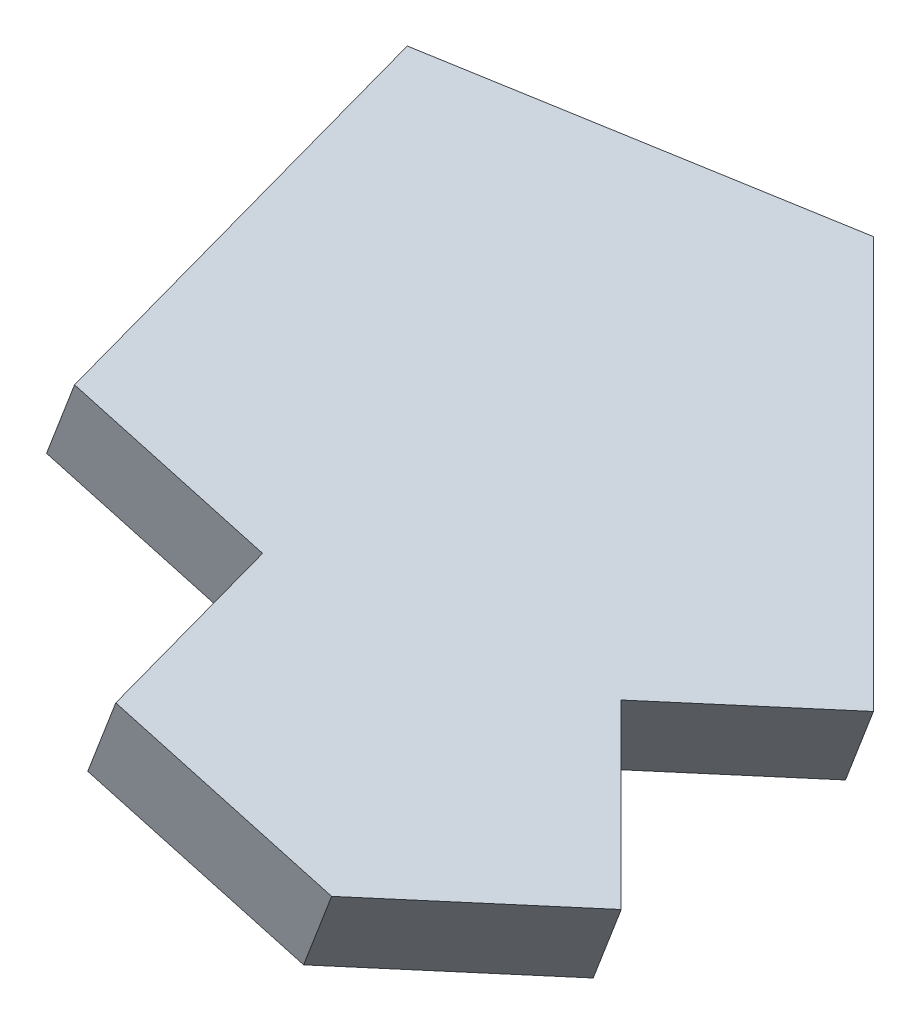
ISO-10303-21;
HEADER;
FILE_DESCRIPTION(('STEP AP214'),'2;1');
FILE_NAME('part.step','',(''),(''),'','','');
FILE_SCHEMA(('AUTOMOTIVE_DESIGN { 1 0 10303 214 1 1 1 1 }'));
ENDSEC;
DATA;
#1=APPLICATION_CONTEXT('core data for automotive mechanical design processes');
#2=APPLICATION_PROTOCOL_DEFINITION('international standard','automotive_design',2000,#1);
#3=PRODUCT_CONTEXT('',#1,'mechanical');
#4=PRODUCT('Part','Part','',(#3));
#5=PRODUCT_RELATED_PRODUCT_CATEGORY('part','',(#4));
#6=PRODUCT_DEFINITION_FORMATION('','',#4);
#7=PRODUCT_DEFINITION_CONTEXT('part definition',#1,'design');
#8=PRODUCT_DEFINITION('design','',#6,#7);
#9=PRODUCT_DEFINITION_SHAPE('','',#8);
#10=(LENGTH_UNIT() NAMED_UNIT(*) SI_UNIT(.MILLI.,.METRE.));
#11=(NAMED_UNIT(*) PLANE_ANGLE_UNIT() SI_UNIT($,.RADIAN.));
#12=(NAMED_UNIT(*) SI_UNIT($,.STERADIAN.) SOLID_ANGLE_UNIT());
#13=UNCERTAINTY_MEASURE_WITH_UNIT(LENGTH_MEASURE(1.E-05),#10,'distance_accuracy_value','');
#14=(GEOMETRIC_REPRESENTATION_CONTEXT(3) GLOBAL_UNCERTAINTY_ASSIGNED_CONTEXT((#13)) GLOBAL_UNIT_ASSIGNED_CONTEXT((#10,
#11,#12)) REPRESENTATION_CONTEXT('',''));
#15=CARTESIAN_POINT('',(0.,0.,0.));
#16=DIRECTION('',(0.,0.,1.));
#17=DIRECTION('',(1.,0.,0.));
#18=AXIS2_PLACEMENT_3D('',#15,#16,#17);
#19=CARTESIAN_POINT('',(38.740977937504,-82.3189480839712,82.4936115759734));
#20=DIRECTION('',(0.866025403784438,-0.467086179482316,-0.178411044884041));
#21=DIRECTION('',(0.474702281385441,0.880146433298151,0.));
#22=AXIS2_PLACEMENT_3D('',#19,#20,#21);
#23=PLANE('',#22);
#24=DIRECTION('',(0.,-0.356822089768082,0.934172358964629));
#25=VECTOR('',#24,1.);
#26=CARTESIAN_POINT('',(37.340977937504,-84.5841956682256,81.6283639917357));
#27=LINE('',#26,#25);
#28=CARTESIAN_POINT('',(37.340977937504,-82.1578054578027,75.2759919507762));
#29=VERTEX_POINT('',#28);
#30=CARTESIAN_POINT('',(37.340977937504,-84.5841956682256,81.6283639917357));
#31=VERTEX_POINT('',#30);
#32=EDGE_CURVE('E137',#29,#31,#27,.T.);
#33=ORIENTED_EDGE('',*,*,#32,.T.);
#34=DIRECTION('',(-0.500000000000002,-0.809016994376602,-0.309016994370612));
#35=VECTOR('',#34,1.);
#36=CARTESIAN_POINT('',(38.740977937504,-82.3189480839712,82.4936115759734));
#37=LINE('',#36,#35);
#38=CARTESIAN_POINT('',(38.740977937504,-82.3189480839712,82.4936115759734));
#39=VERTEX_POINT('',#38);
#40=EDGE_CURVE('E11',#39,#31,#37,.T.);
#41=ORIENTED_EDGE('',*,*,#40,.F.);
#42=DIRECTION('',(0.,-0.356822089768082,0.934172358964629));
#43=VECTOR('',#42,1.);
#44=CARTESIAN_POINT('',(38.740977937504,-82.3189480839712,82.4936115759734));
#45=LINE('',#44,#43);
#46=CARTESIAN_POINT('',(38.740977937504,-79.8925578735482,76.141239535014));
#47=VERTEX_POINT('',#46);
#48=EDGE_CURVE('E156',#47,#39,#45,.T.);
#49=ORIENTED_EDGE('',*,*,#48,.F.);
#50=DIRECTION('',(-0.500000000000002,-0.809016994376602,-0.309016994370612));
#51=VECTOR('',#50,1.);
#52=CARTESIAN_POINT('',(38.740977937504,-79.8925578735482,76.141239535014));
#53=LINE('',#52,#51);
#54=EDGE_CURVE('E133',#47,#29,#53,.T.);
#55=ORIENTED_EDGE('',*,*,#54,.T.);
#56=EDGE_LOOP('',(#33,#41,#49,#55));
#57=FACE_BOUND('',#56,.T.);
#58=ADVANCED_FACE('F34',(#57),#23,.F.);
#59=CARTESIAN_POINT('',(41.7174675795878,-83.9243018866373,81.8804209872687));
#60=DIRECTION('',(-1.53008418807078E-11,0.356822089776337,-0.934172358961476));
#61=DIRECTION('',(0.,0.934172358961476,0.356822089776337));
#62=AXIS2_PLACEMENT_3D('',#59,#60,#61);
#63=PLANE('',#62);
#64=DIRECTION('',(0.866025403784435,-0.467086179476016,-0.178411044900549));
#65=VECTOR('',#64,1.);
#66=CARTESIAN_POINT('',(40.3174675795878,-86.1895494708918,81.015173403031));
#67=LINE('',#66,#65);
#68=CARTESIAN_POINT('',(40.3174675795878,-86.1895494708918,81.015173403031));
#69=VERTEX_POINT('',#68);
#70=EDGE_CURVE('E140',#31,#69,#67,.T.);
#71=ORIENTED_EDGE('',*,*,#70,.T.);
#72=DIRECTION('',(-0.500000000000002,-0.809016994376602,-0.309016994370612));
#73=VECTOR('',#72,1.);
#74=CARTESIAN_POINT('',(41.7174675795878,-83.9243018866373,81.8804209872687));
#75=LINE('',#74,#73);
#76=CARTESIAN_POINT('',(41.7174675795878,-83.9243018866373,81.8804209872687));
#77=VERTEX_POINT('',#76);
#78=EDGE_CURVE('E42',#77,#69,#75,.T.);
#79=ORIENTED_EDGE('',*,*,#78,.F.);
#80=DIRECTION('',(0.866025403784435,-0.467086179476016,-0.178411044900549));
#81=VECTOR('',#80,1.);
#82=CARTESIAN_POINT('',(41.7174675795878,-83.9243018866373,81.8804209872687));
#83=LINE('',#82,#81);
#84=EDGE_CURVE('E94',#39,#77,#83,.T.);
#85=ORIENTED_EDGE('',*,*,#84,.F.);
#86=ORIENTED_EDGE('',*,*,#40,.T.);
#87=EDGE_LOOP('',(#71,#79,#85,#86));
#88=FACE_BOUND('',#87,.T.);
#89=ADVANCED_FACE('F195',(#88),#63,.F.);
#90=CARTESIAN_POINT('',(41.7174675795878,-83.9243018866373,81.8804209872687));
#91=DIRECTION('',(0.866025403784438,-0.467086179480995,-0.178411044887498));
#92=DIRECTION('',(0.474702281384402,0.880146433298712,0.));
#93=AXIS2_PLACEMENT_3D('',#90,#91,#92);
#94=PLANE('',#93);
#95=DIRECTION('',(3.20576898360513E-12,-0.356822089769809,0.934172358963969));
#96=VECTOR('',#95,1.);
#97=CARTESIAN_POINT('',(40.3174675795878,-86.1895494708918,81.015173403031));
#98=LINE('',#97,#96);
#99=CARTESIAN_POINT('',(40.3174675795974,-87.2600157402013,83.8176904799229));
#100=VERTEX_POINT('',#99);
#101=EDGE_CURVE('E142',#69,#100,#98,.T.);
#102=ORIENTED_EDGE('',*,*,#101,.T.);
#103=DIRECTION('',(-0.500000000000002,-0.809016994376602,-0.309016994370612));
#104=VECTOR('',#103,1.);
#105=CARTESIAN_POINT('',(41.7174675795974,-84.9947681559468,84.6829380641606));
#106=LINE('',#105,#104);
#107=CARTESIAN_POINT('',(41.7174675795974,-84.9947681559468,84.6829380641606));
#108=VERTEX_POINT('',#107);
#109=EDGE_CURVE('E166',#108,#100,#106,.T.);
#110=ORIENTED_EDGE('',*,*,#109,.F.);
#111=DIRECTION('',(3.20576898360513E-12,-0.356822089769809,0.934172358963969));
#112=VECTOR('',#111,1.);
#113=CARTESIAN_POINT('',(41.7174675795878,-83.9243018866373,81.8804209872687));
#114=LINE('',#113,#112);
#115=EDGE_CURVE('E174',#77,#108,#114,.T.);
#116=ORIENTED_EDGE('',*,*,#115,.F.);
#117=ORIENTED_EDGE('',*,*,#78,.T.);
#118=EDGE_LOOP('',(#102,#110,#116,#117));
#119=FACE_BOUND('',#118,.T.);
#120=ADVANCED_FACE('F172',(#119),#94,.F.);
#121=CARTESIAN_POINT('',(44.1423387101939,-86.3026094585189,84.183387138542));
#122=DIRECTION('',(0.,0.356822089768079,-0.93417235896463));
#123=DIRECTION('',(0.,0.93417235896463,0.356822089768079));
#124=AXIS2_PLACEMENT_3D('',#121,#122,#123);
#125=PLANE('',#124);
#126=DIRECTION('',(0.866025403784432,-0.467086179482328,-0.178411044884036));
#127=VECTOR('',#126,1.);
#128=CARTESIAN_POINT('',(42.7423387101939,-88.5678570427734,83.3181395543043));
#129=LINE('',#128,#127);
#130=CARTESIAN_POINT('',(43.7347155175936,-89.1030901774478,83.1136986887671));
#131=VERTEX_POINT('',#130);
#132=EDGE_CURVE('E145',#100,#131,#129,.T.);
#133=ORIENTED_EDGE('',*,*,#132,.T.);
#134=DIRECTION('',(-0.500000000000002,-0.809016994376602,-0.309016994370612));
#135=VECTOR('',#134,1.);
#136=CARTESIAN_POINT('',(45.1347155175936,-86.8378425931933,83.9789462730048));
#137=LINE('',#136,#135);
#138=CARTESIAN_POINT('',(45.1347155175936,-86.8378425931933,83.9789462730048));
#139=VERTEX_POINT('',#138);
#140=EDGE_CURVE('E163',#139,#131,#137,.T.);
#141=ORIENTED_EDGE('',*,*,#140,.F.);
#142=DIRECTION('',(0.866025403784438,-0.467086179490049,-0.178411044863795));
#143=VECTOR('',#142,1.);
#144=CARTESIAN_POINT('',(44.1423387101939,-86.3026094585189,84.183387138542));
#145=LINE('',#144,#143);
#146=EDGE_CURVE('E186',#108,#139,#145,.T.);
#147=ORIENTED_EDGE('',*,*,#146,.F.);
#148=ORIENTED_EDGE('',*,*,#109,.T.);
#149=EDGE_LOOP('',(#133,#141,#147,#148));
#150=FACE_BOUND('',#149,.T.);
#151=ADVANCED_FACE('F179',(#150),#125,.F.);
#152=CARTESIAN_POINT('',(47.6817817459845,-87.2729334479331,80.9967891897347));
#153=DIRECTION('',(-0.577350269204418,0.57735026918906,-0.577350269175399));
#154=DIRECTION('',(-0.707106781177143,-0.707106781195952,0.));
#155=AXIS2_PLACEMENT_3D('',#152,#153,#154);
#156=PLANE('',#155);
#157=DIRECTION('',(0.645497224354671,-0.110264089699086,-0.755761314088811));
#158=VECTOR('',#157,1.);
#159=CARTESIAN_POINT('',(46.2817817459845,-89.5381810321876,80.131541605497));
#160=LINE('',#159,#158);
#161=CARTESIAN_POINT('',(46.2817817459845,-89.5381810321876,80.131541605497));
#162=VERTEX_POINT('',#161);
#163=EDGE_CURVE('E148',#131,#162,#160,.T.);
#164=ORIENTED_EDGE('',*,*,#163,.T.);
#165=DIRECTION('',(-0.500000000000002,-0.809016994376602,-0.309016994370612));
#166=VECTOR('',#165,1.);
#167=CARTESIAN_POINT('',(47.6817817459845,-87.2729334479331,80.9967891897347));
#168=LINE('',#167,#166);
#169=CARTESIAN_POINT('',(47.6817817459845,-87.2729334479331,80.9967891897347));
#170=VERTEX_POINT('',#169);
#171=EDGE_CURVE('E160',#170,#162,#168,.T.);
#172=ORIENTED_EDGE('',*,*,#171,.F.);
#173=DIRECTION('',(0.645497224354326,-0.110264089698741,-0.755761314089157));
#174=VECTOR('',#173,1.);
#175=CARTESIAN_POINT('',(45.8743895177608,-86.9641939967704,83.1129208692192));
#176=LINE('',#175,#174);
#177=EDGE_CURVE('E185',#139,#170,#176,.T.);
#178=ORIENTED_EDGE('',*,*,#177,.F.);
#179=ORIENTED_EDGE('',*,*,#140,.T.);
#180=EDGE_LOOP('',(#164,#172,#178,#179));
#181=FACE_BOUND('',#180,.T.);
#182=ADVANCED_FACE('F183',(#181),#156,.F.);
#183=CARTESIAN_POINT('',(45.9497309384079,-85.5408826403721,79.2647383821656));
#184=DIRECTION('',(-0.645497224365596,0.110264089710013,0.755761314077886));
#185=DIRECTION('',(0.76039797422379,0.,0.649457404913021));
#186=AXIS2_PLACEMENT_3D('',#183,#184,#185);
#187=PLANE('',#186);
#188=DIRECTION('',(-0.577350269192204,0.577350269186972,-0.577350269189701));
#189=VECTOR('',#188,1.);
#190=CARTESIAN_POINT('',(44.5497309384079,-87.8061302246266,78.3994907979279));
#191=LINE('',#190,#189);
#192=CARTESIAN_POINT('',(44.5497309384079,-87.8061302246266,78.3994907979279));
#193=VERTEX_POINT('',#192);
#194=EDGE_CURVE('E150',#162,#193,#191,.T.);
#195=ORIENTED_EDGE('',*,*,#194,.T.);
#196=DIRECTION('',(-0.500000000000002,-0.809016994376602,-0.309016994370612));
#197=VECTOR('',#196,1.);
#198=CARTESIAN_POINT('',(45.9497309384079,-85.5408826403721,79.2647383821656));
#199=LINE('',#198,#197);
#200=CARTESIAN_POINT('',(45.9497309384079,-85.5408826403721,79.2647383821656));
#201=VERTEX_POINT('',#200);
#202=EDGE_CURVE('E128',#201,#193,#199,.T.);
#203=ORIENTED_EDGE('',*,*,#202,.F.);
#204=DIRECTION('',(-0.577350269192204,0.577350269186972,-0.577350269189701));
#205=VECTOR('',#204,1.);
#206=CARTESIAN_POINT('',(45.9497309384079,-85.5408826403721,79.2647383821656));
#207=LINE('',#206,#205);
#208=EDGE_CURVE('E117',#170,#201,#207,.T.);
#209=ORIENTED_EDGE('',*,*,#208,.F.);
#210=ORIENTED_EDGE('',*,*,#171,.T.);
#211=EDGE_LOOP('',(#195,#203,#209,#210));
#212=FACE_BOUND('',#211,.T.);
#213=ADVANCED_FACE('F207',(#212),#187,.F.);
#214=CARTESIAN_POINT('',(45.9497309384079,-85.5408826403721,79.2647383821656));
#215=DIRECTION('',(-0.577350269183196,0.577350269185435,-0.577350269200246));
#216=DIRECTION('',(0.,0.707106781195618,0.707106781177478));
#217=AXIS2_PLACEMENT_3D('',#214,#215,#216);
#218=PLANE('',#217);
#219=DIRECTION('',(0.645497224373654,-0.110264089718066,-0.755761314069829));
#220=VECTOR('',#219,1.);
#221=CARTESIAN_POINT('',(44.5497309384079,-87.8061302246266,78.3994907979279));
#222=LINE('',#221,#220);
#223=CARTESIAN_POINT('',(46.7682753297688,-88.1851028500316,75.8019737812372));
#224=VERTEX_POINT('',#223);
#225=EDGE_CURVE('E126',#193,#224,#222,.T.);
#226=ORIENTED_EDGE('',*,*,#225,.T.);
#227=DIRECTION('',(-0.500000000000002,-0.809016994376602,-0.309016994370612));
#228=VECTOR('',#227,1.);
#229=CARTESIAN_POINT('',(48.1682753297688,-85.9198552657772,76.6672213654749));
#230=LINE('',#229,#228);
#231=CARTESIAN_POINT('',(48.1682753297688,-85.9198552657772,76.6672213654749));
#232=VERTEX_POINT('',#231);
#233=EDGE_CURVE('E123',#232,#224,#230,.T.);
#234=ORIENTED_EDGE('',*,*,#233,.F.);
#235=DIRECTION('',(0.645497224373654,-0.110264089718066,-0.755761314069829));
#236=VECTOR('',#235,1.);
#237=CARTESIAN_POINT('',(45.9497309384079,-85.5408826403721,79.2647383821656));
#238=LINE('',#237,#236);
#239=EDGE_CURVE('E110',#201,#232,#238,.T.);
#240=ORIENTED_EDGE('',*,*,#239,.F.);
#241=ORIENTED_EDGE('',*,*,#202,.T.);
#242=EDGE_LOOP('',(#226,#234,#240,#241));
#243=FACE_BOUND('',#242,.T.);
#244=ADVANCED_FACE('F124',(#243),#218,.F.);
#245=CARTESIAN_POINT('',(48.1682753297688,-85.9198552657772,76.6672213654749));
#246=DIRECTION('',(-0.645497224363455,0.110264089707872,0.755761314080027));
#247=DIRECTION('',(0.760397974225763,0.,0.649457404910712));
#248=AXIS2_PLACEMENT_3D('',#245,#246,#247);
#249=PLANE('',#248);
#250=DIRECTION('',(-0.577350269194598,0.57735026918738,-0.577350269186899));
#251=VECTOR('',#250,1.);
#252=CARTESIAN_POINT('',(46.7682753297688,-88.1851028500316,75.8019737812372));
#253=LINE('',#252,#251);
#254=CARTESIAN_POINT('',(42.8422934992455,-84.2591210195575,71.8759919507663));
#255=VERTEX_POINT('',#254);
#256=EDGE_CURVE('E153',#224,#255,#253,.T.);
#257=ORIENTED_EDGE('',*,*,#256,.T.);
#258=DIRECTION('',(-0.500000000000002,-0.809016994376602,-0.309016994370612));
#259=VECTOR('',#258,1.);
#260=CARTESIAN_POINT('',(44.2422934992455,-81.993873435303,72.741239535004));
#261=LINE('',#260,#259);
#262=CARTESIAN_POINT('',(44.2422934992455,-81.993873435303,72.741239535004));
#263=VERTEX_POINT('',#262);
#264=EDGE_CURVE('E129',#263,#255,#261,.T.);
#265=ORIENTED_EDGE('',*,*,#264,.F.);
#266=DIRECTION('',(-0.577350269194598,0.57735026918738,-0.577350269186899));
#267=VECTOR('',#266,1.);
#268=CARTESIAN_POINT('',(48.1682753297688,-85.9198552657772,76.6672213654749));
#269=LINE('',#268,#267);
#270=EDGE_CURVE('E114',#232,#263,#269,.T.);
#271=ORIENTED_EDGE('',*,*,#270,.F.);
#272=ORIENTED_EDGE('',*,*,#233,.T.);
#273=EDGE_LOOP('',(#257,#265,#271,#272));
#274=FACE_BOUND('',#273,.T.);
#275=ADVANCED_FACE('F131',(#274),#249,.F.);
#276=CARTESIAN_POINT('',(38.740977937504,-79.8925578735482,76.141239535014));
#277=DIRECTION('',(0.309016994378062,-0.499999999996855,0.809016994375701));
#278=DIRECTION('',(0.,-0.850650808353738,-0.525731112116386));
#279=AXIS2_PLACEMENT_3D('',#276,#277,#278);
#280=PLANE('',#279);
#281=DIRECTION('',(-0.809016994373759,0.3090169943757,0.500000000001459));
#282=VECTOR('',#281,1.);
#283=CARTESIAN_POINT('',(37.340977937504,-82.1578054578027,75.2759919507762));
#284=LINE('',#283,#282);
#285=EDGE_CURVE('E82',#255,#29,#284,.T.);
#286=ORIENTED_EDGE('',*,*,#285,.T.);
#287=ORIENTED_EDGE('',*,*,#54,.F.);
#288=DIRECTION('',(-0.809016994373752,0.309016994375703,0.500000000001467));
#289=VECTOR('',#288,1.);
#290=CARTESIAN_POINT('',(44.2422934992455,-81.993873435303,72.741239535004));
#291=LINE('',#290,#289);
#292=EDGE_CURVE('E50',#263,#47,#291,.T.);
#293=ORIENTED_EDGE('',*,*,#292,.F.);
#294=ORIENTED_EDGE('',*,*,#264,.T.);
#295=EDGE_LOOP('',(#286,#287,#293,#294));
#296=FACE_BOUND('',#295,.T.);
#297=ADVANCED_FACE('F215',(#296),#280,.F.);
#298=CARTESIAN_POINT('',(-10.867505543201,-17.5839933418625,-6.71648779853159));
#299=DIRECTION('',(-0.500000000000011,-0.809016994376598,-0.309016994370608));
#300=DIRECTION('',(0.850650808352514,-0.525731112118366,0.));
#301=AXIS2_PLACEMENT_3D('',#298,#299,#300);
#302=PLANE('',#301);
#303=ORIENTED_EDGE('',*,*,#48,.T.);
#304=ORIENTED_EDGE('',*,*,#84,.T.);
#305=ORIENTED_EDGE('',*,*,#115,.T.);
#306=ORIENTED_EDGE('',*,*,#146,.T.);
#307=ORIENTED_EDGE('',*,*,#177,.T.);
#308=ORIENTED_EDGE('',*,*,#208,.T.);
#309=ORIENTED_EDGE('',*,*,#239,.T.);
#310=ORIENTED_EDGE('',*,*,#270,.T.);
#311=ORIENTED_EDGE('',*,*,#292,.T.);
#312=EDGE_LOOP('',(#303,#304,#305,#306,#307,#308,#309,#310,#311));
#313=FACE_BOUND('',#312,.T.);
#314=ADVANCED_FACE('F112',(#313),#302,.F.);
#315=CARTESIAN_POINT('',(-12.267505543201,-19.849240926117,-7.5817353827693));
#316=DIRECTION('',(-0.500000000000011,-0.809016994376598,-0.309016994370608));
#317=DIRECTION('',(0.850650808352514,-0.525731112118366,0.));
#318=AXIS2_PLACEMENT_3D('',#315,#316,#317);
#319=PLANE('',#318);
#320=ORIENTED_EDGE('',*,*,#32,.F.);
#321=ORIENTED_EDGE('',*,*,#285,.F.);
#322=ORIENTED_EDGE('',*,*,#256,.F.);
#323=ORIENTED_EDGE('',*,*,#225,.F.);
#324=ORIENTED_EDGE('',*,*,#194,.F.);
#325=ORIENTED_EDGE('',*,*,#163,.F.);
#326=ORIENTED_EDGE('',*,*,#132,.F.);
#327=ORIENTED_EDGE('',*,*,#101,.F.);
#328=ORIENTED_EDGE('',*,*,#70,.F.);
#329=EDGE_LOOP('',(#320,#321,#322,#323,#324,#325,#326,#327,#328));
#330=FACE_BOUND('',#329,.T.);
#331=ADVANCED_FACE('F175',(#330),#319,.T.);
#332=CLOSED_SHELL('',(#58,#89,#120,#151,#182,#213,#244,#275,#297,#314,#331));
#333=MANIFOLD_SOLID_BREP('B2',#332);
#334=ADVANCED_BREP_SHAPE_REPRESENTATION('',(#18,#333),#14);
#335=SHAPE_DEFINITION_REPRESENTATION(#9,#334);
ENDSEC;
END-ISO-10303-21;
